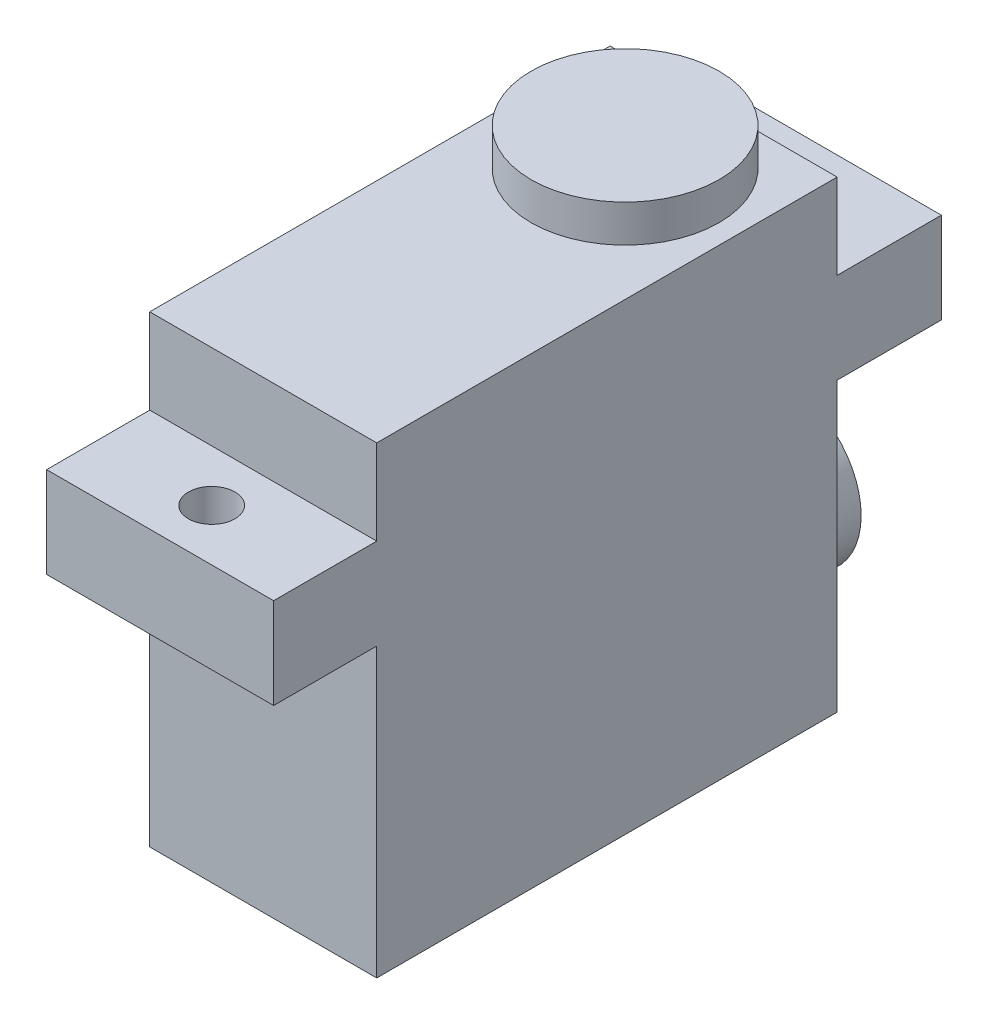
ISO-10303-21;
HEADER;
FILE_DESCRIPTION(('STEP AP214'),'2;1');
FILE_NAME('part.step','',(''),(''),'','','');
FILE_SCHEMA(('AUTOMOTIVE_DESIGN { 1 0 10303 214 1 1 1 1 }'));
ENDSEC;
DATA;
#1=APPLICATION_CONTEXT('core data for automotive mechanical design processes');
#2=APPLICATION_PROTOCOL_DEFINITION('international standard','automotive_design',2000,#1);
#3=PRODUCT_CONTEXT('',#1,'mechanical');
#4=PRODUCT('Part','Part','',(#3));
#5=PRODUCT_RELATED_PRODUCT_CATEGORY('part','',(#4));
#6=PRODUCT_DEFINITION_FORMATION('','',#4);
#7=PRODUCT_DEFINITION_CONTEXT('part definition',#1,'design');
#8=PRODUCT_DEFINITION('design','',#6,#7);
#9=PRODUCT_DEFINITION_SHAPE('','',#8);
#10=(LENGTH_UNIT() NAMED_UNIT(*) SI_UNIT(.MILLI.,.METRE.));
#11=(NAMED_UNIT(*) PLANE_ANGLE_UNIT() SI_UNIT($,.RADIAN.));
#12=(NAMED_UNIT(*) SI_UNIT($,.STERADIAN.) SOLID_ANGLE_UNIT());
#13=UNCERTAINTY_MEASURE_WITH_UNIT(LENGTH_MEASURE(1.E-05),#10,'distance_accuracy_value','');
#14=(GEOMETRIC_REPRESENTATION_CONTEXT(3) GLOBAL_UNCERTAINTY_ASSIGNED_CONTEXT((#13)) GLOBAL_UNIT_ASSIGNED_CONTEXT((#10,
#11,#12)) REPRESENTATION_CONTEXT('',''));
#15=CARTESIAN_POINT('',(0.,0.,0.));
#16=DIRECTION('',(0.,0.,1.));
#17=DIRECTION('',(1.,0.,0.));
#18=AXIS2_PLACEMENT_3D('',#15,#16,#17);
#19=CARTESIAN_POINT('',(0.,31.115,0.));
#20=DIRECTION('',(0.,0.,-1.));
#21=DIRECTION('',(-1.,0.,0.));
#22=AXIS2_PLACEMENT_3D('',#19,#20,#21);
#23=PLANE('',#22);
#24=DIRECTION('',(0.,-1.,0.));
#25=VECTOR('',#24,1.);
#26=CARTESIAN_POINT('',(0.,31.115,0.));
#27=LINE('',#26,#25);
#28=CARTESIAN_POINT('',(0.,31.115,0.));
#29=VERTEX_POINT('',#28);
#30=CARTESIAN_POINT('',(0.,25.4,0.));
#31=VERTEX_POINT('',#30);
#32=EDGE_CURVE('E214',#29,#31,#27,.T.);
#33=ORIENTED_EDGE('',*,*,#32,.T.);
#34=DIRECTION('',(1.,0.,0.));
#35=VECTOR('',#34,1.);
#36=CARTESIAN_POINT('',(0.,25.4,0.));
#37=LINE('',#36,#35);
#38=CARTESIAN_POINT('',(15.2399999999999,25.4,0.));
#39=VERTEX_POINT('',#38);
#40=EDGE_CURVE('E179',#31,#39,#37,.T.);
#41=ORIENTED_EDGE('',*,*,#40,.T.);
#42=DIRECTION('',(0.,-1.,0.));
#43=VECTOR('',#42,1.);
#44=CARTESIAN_POINT('',(15.2399999999999,31.115,0.));
#45=LINE('',#44,#43);
#46=CARTESIAN_POINT('',(15.2399999999999,31.115,0.));
#47=VERTEX_POINT('',#46);
#48=EDGE_CURVE('E211',#47,#39,#45,.T.);
#49=ORIENTED_EDGE('',*,*,#48,.F.);
#50=DIRECTION('',(1.,0.,0.));
#51=VECTOR('',#50,1.);
#52=CARTESIAN_POINT('',(0.,31.115,0.));
#53=LINE('',#52,#51);
#54=EDGE_CURVE('E186',#29,#47,#53,.T.);
#55=ORIENTED_EDGE('',*,*,#54,.F.);
#56=EDGE_LOOP('',(#33,#41,#49,#55));
#57=FACE_BOUND('',#56,.T.);
#58=ADVANCED_FACE('F38',(#57),#23,.F.);
#59=CARTESIAN_POINT('',(0.,31.115,-30.9117999999999));
#60=DIRECTION('',(0.,0.,1.));
#61=DIRECTION('',(1.,0.,0.));
#62=AXIS2_PLACEMENT_3D('',#59,#60,#61);
#63=PLANE('',#62);
#64=DIRECTION('',(0.,-1.,0.));
#65=VECTOR('',#64,1.);
#66=CARTESIAN_POINT('',(15.2399999999999,31.115,-30.9118));
#67=LINE('',#66,#65);
#68=CARTESIAN_POINT('',(15.2399999999999,31.115,-30.9118));
#69=VERTEX_POINT('',#68);
#70=CARTESIAN_POINT('',(15.2399999999999,25.4,-30.9118));
#71=VERTEX_POINT('',#70);
#72=EDGE_CURVE('E207',#69,#71,#67,.T.);
#73=ORIENTED_EDGE('',*,*,#72,.T.);
#74=DIRECTION('',(-1.,0.,0.));
#75=VECTOR('',#74,1.);
#76=CARTESIAN_POINT('',(0.,25.4,-30.9117999999999));
#77=LINE('',#76,#75);
#78=CARTESIAN_POINT('',(0.,25.4,-30.9118));
#79=VERTEX_POINT('',#78);
#80=EDGE_CURVE('E219',#71,#79,#77,.T.);
#81=ORIENTED_EDGE('',*,*,#80,.T.);
#82=DIRECTION('',(0.,-1.,0.));
#83=VECTOR('',#82,1.);
#84=CARTESIAN_POINT('',(0.,31.115,-30.9117999999999));
#85=LINE('',#84,#83);
#86=CARTESIAN_POINT('',(0.,31.115,-30.9117999999999));
#87=VERTEX_POINT('',#86);
#88=EDGE_CURVE('E203',#87,#79,#85,.T.);
#89=ORIENTED_EDGE('',*,*,#88,.F.);
#90=DIRECTION('',(-1.,0.,0.));
#91=VECTOR('',#90,1.);
#92=CARTESIAN_POINT('',(0.,31.115,-30.9117999999999));
#93=LINE('',#92,#91);
#94=EDGE_CURVE('E191',#69,#87,#93,.T.);
#95=ORIENTED_EDGE('',*,*,#94,.F.);
#96=EDGE_LOOP('',(#73,#81,#89,#95));
#97=FACE_BOUND('',#96,.T.);
#98=ADVANCED_FACE('F232',(#97),#63,.F.);
#99=CARTESIAN_POINT('',(0.,31.115,0.));
#100=DIRECTION('',(1.,0.,0.));
#101=DIRECTION('',(0.,0.,-1.));
#102=AXIS2_PLACEMENT_3D('',#99,#100,#101);
#103=PLANE('',#102);
#104=CARTESIAN_POINT('',(0.,19.304,0.));
#105=VERTEX_POINT('',#104);
#106=CARTESIAN_POINT('',(0.,0.,0.));
#107=VERTEX_POINT('',#106);
#108=EDGE_CURVE('E131',#105,#107,#27,.T.);
#109=ORIENTED_EDGE('',*,*,#108,.F.);
#110=DIRECTION('',(0.,0.,1.));
#111=VECTOR('',#110,1.);
#112=CARTESIAN_POINT('',(0.,19.304,-37.9095));
#113=LINE('',#112,#111);
#114=CARTESIAN_POINT('',(0.,19.304,6.9215));
#115=VERTEX_POINT('',#114);
#116=EDGE_CURVE('E53',#105,#115,#113,.T.);
#117=ORIENTED_EDGE('',*,*,#116,.T.);
#118=DIRECTION('',(0.,-1.,0.));
#119=VECTOR('',#118,1.);
#120=CARTESIAN_POINT('',(0.,25.4,6.9215));
#121=LINE('',#120,#119);
#122=CARTESIAN_POINT('',(0.,25.4,6.9215));
#123=VERTEX_POINT('',#122);
#124=EDGE_CURVE('E129',#123,#115,#121,.T.);
#125=ORIENTED_EDGE('',*,*,#124,.F.);
#126=DIRECTION('',(0.,0.,1.));
#127=VECTOR('',#126,1.);
#128=CARTESIAN_POINT('',(0.,25.4,-37.9095));
#129=LINE('',#128,#127);
#130=EDGE_CURVE('E171',#31,#123,#129,.T.);
#131=ORIENTED_EDGE('',*,*,#130,.F.);
#132=ORIENTED_EDGE('',*,*,#32,.F.);
#133=DIRECTION('',(0.,0.,1.));
#134=VECTOR('',#133,1.);
#135=CARTESIAN_POINT('',(0.,31.115,0.));
#136=LINE('',#135,#134);
#137=EDGE_CURVE('E183',#87,#29,#136,.T.);
#138=ORIENTED_EDGE('',*,*,#137,.F.);
#139=ORIENTED_EDGE('',*,*,#88,.T.);
#140=CARTESIAN_POINT('',(0.,25.4,-37.9095));
#141=VERTEX_POINT('',#140);
#142=EDGE_CURVE('E168',#141,#79,#129,.T.);
#143=ORIENTED_EDGE('',*,*,#142,.F.);
#144=DIRECTION('',(0.,-1.,0.));
#145=VECTOR('',#144,1.);
#146=CARTESIAN_POINT('',(0.,25.4,-37.9095));
#147=LINE('',#146,#145);
#148=CARTESIAN_POINT('',(0.,19.304,-37.9095));
#149=VERTEX_POINT('',#148);
#150=EDGE_CURVE('E158',#141,#149,#147,.T.);
#151=ORIENTED_EDGE('',*,*,#150,.T.);
#152=CARTESIAN_POINT('',(0.,19.304,-30.9118));
#153=VERTEX_POINT('',#152);
#154=EDGE_CURVE('E132',#149,#153,#113,.T.);
#155=ORIENTED_EDGE('',*,*,#154,.T.);
#156=CARTESIAN_POINT('',(0.,0.,-30.9117999999999));
#157=VERTEX_POINT('',#156);
#158=EDGE_CURVE('E193',#153,#157,#85,.T.);
#159=ORIENTED_EDGE('',*,*,#158,.T.);
#160=DIRECTION('',(0.,0.,1.));
#161=VECTOR('',#160,1.);
#162=CARTESIAN_POINT('',(0.,0.,0.));
#163=LINE('',#162,#161);
#164=EDGE_CURVE('E182',#157,#107,#163,.T.);
#165=ORIENTED_EDGE('',*,*,#164,.T.);
#166=EDGE_LOOP('',(#109,#117,#125,#131,#132,#138,#139,#143,#151,#155,#159,#165));
#167=FACE_BOUND('',#166,.T.);
#168=ADVANCED_FACE('F40',(#167),#103,.F.);
#169=CARTESIAN_POINT('',(15.2399999999999,19.304,0.));
#170=VERTEX_POINT('',#169);
#171=CARTESIAN_POINT('',(15.2399999999999,0.,0.));
#172=VERTEX_POINT('',#171);
#173=EDGE_CURVE('E210',#170,#172,#45,.T.);
#174=ORIENTED_EDGE('',*,*,#173,.F.);
#175=DIRECTION('',(-1.,0.,0.));
#176=VECTOR('',#175,1.);
#177=CARTESIAN_POINT('',(0.,19.304,0.));
#178=LINE('',#177,#176);
#179=EDGE_CURVE('E170',#170,#105,#178,.T.);
#180=ORIENTED_EDGE('',*,*,#179,.T.);
#181=ORIENTED_EDGE('',*,*,#108,.T.);
#182=DIRECTION('',(1.,0.,0.));
#183=VECTOR('',#182,1.);
#184=CARTESIAN_POINT('',(0.,0.,0.));
#185=LINE('',#184,#183);
#186=EDGE_CURVE('E195',#107,#172,#185,.T.);
#187=ORIENTED_EDGE('',*,*,#186,.T.);
#188=EDGE_LOOP('',(#174,#180,#181,#187));
#189=FACE_BOUND('',#188,.T.);
#190=ADVANCED_FACE('F252',(#189),#23,.F.);
#191=CARTESIAN_POINT('',(15.2399999999999,31.115,0.));
#192=DIRECTION('',(-1.,0.,0.));
#193=DIRECTION('',(0.,0.,1.));
#194=AXIS2_PLACEMENT_3D('',#191,#192,#193);
#195=PLANE('',#194);
#196=CARTESIAN_POINT('',(15.2399999999999,19.304,-30.9118));
#197=VERTEX_POINT('',#196);
#198=CARTESIAN_POINT('',(15.2399999999999,0.,-30.9118));
#199=VERTEX_POINT('',#198);
#200=EDGE_CURVE('E206',#197,#199,#67,.T.);
#201=ORIENTED_EDGE('',*,*,#200,.F.);
#202=DIRECTION('',(0.,0.,1.));
#203=VECTOR('',#202,1.);
#204=CARTESIAN_POINT('',(15.2399999999999,19.304,-37.9095));
#205=LINE('',#204,#203);
#206=CARTESIAN_POINT('',(15.2399999999999,19.304,-37.9095));
#207=VERTEX_POINT('',#206);
#208=EDGE_CURVE('E61',#207,#197,#205,.T.);
#209=ORIENTED_EDGE('',*,*,#208,.F.);
#210=DIRECTION('',(0.,1.,0.));
#211=VECTOR('',#210,1.);
#212=CARTESIAN_POINT('',(15.2399999999999,25.4,-37.9095));
#213=LINE('',#212,#211);
#214=CARTESIAN_POINT('',(15.2399999999999,25.4,-37.9095));
#215=VERTEX_POINT('',#214);
#216=EDGE_CURVE('E163',#207,#215,#213,.T.);
#217=ORIENTED_EDGE('',*,*,#216,.T.);
#218=DIRECTION('',(0.,0.,1.));
#219=VECTOR('',#218,1.);
#220=CARTESIAN_POINT('',(15.2399999999999,25.4,-37.9095));
#221=LINE('',#220,#219);
#222=EDGE_CURVE('E172',#215,#71,#221,.T.);
#223=ORIENTED_EDGE('',*,*,#222,.T.);
#224=ORIENTED_EDGE('',*,*,#72,.F.);
#225=DIRECTION('',(0.,0.,-1.));
#226=VECTOR('',#225,1.);
#227=CARTESIAN_POINT('',(15.2399999999999,31.115,0.));
#228=LINE('',#227,#226);
#229=EDGE_CURVE('E189',#47,#69,#228,.T.);
#230=ORIENTED_EDGE('',*,*,#229,.F.);
#231=ORIENTED_EDGE('',*,*,#48,.T.);
#232=CARTESIAN_POINT('',(15.2399999999999,25.4,6.9215));
#233=VERTEX_POINT('',#232);
#234=EDGE_CURVE('E175',#39,#233,#221,.T.);
#235=ORIENTED_EDGE('',*,*,#234,.T.);
#236=DIRECTION('',(0.,1.,0.));
#237=VECTOR('',#236,1.);
#238=CARTESIAN_POINT('',(15.2399999999999,25.4,6.9215));
#239=LINE('',#238,#237);
#240=CARTESIAN_POINT('',(15.2399999999999,19.304,6.9215));
#241=VERTEX_POINT('',#240);
#242=EDGE_CURVE('E143',#241,#233,#239,.T.);
#243=ORIENTED_EDGE('',*,*,#242,.F.);
#244=EDGE_CURVE('E139',#170,#241,#205,.T.);
#245=ORIENTED_EDGE('',*,*,#244,.F.);
#246=ORIENTED_EDGE('',*,*,#173,.T.);
#247=DIRECTION('',(0.,0.,-1.));
#248=VECTOR('',#247,1.);
#249=CARTESIAN_POINT('',(15.2399999999999,0.,0.));
#250=LINE('',#249,#248);
#251=EDGE_CURVE('E198',#172,#199,#250,.T.);
#252=ORIENTED_EDGE('',*,*,#251,.T.);
#253=EDGE_LOOP('',(#201,#209,#217,#223,#224,#230,#231,#235,#243,#245,#246,#252));
#254=FACE_BOUND('',#253,.T.);
#255=ADVANCED_FACE('F230',(#254),#195,.F.);
#256=CARTESIAN_POINT('',(7.61999999999996,8.2804,-30.9118));
#257=DIRECTION('',(0.,0.,1.));
#258=DIRECTION('',(1.,0.,0.));
#259=AXIS2_PLACEMENT_3D('',#256,#257,#258);
#260=CIRCLE('',#259,5.2705);
#261=CARTESIAN_POINT('',(12.8905,8.2804,-30.9118));
#262=VERTEX_POINT('',#261);
#263=EDGE_CURVE('E46',#262,#262,#260,.F.);
#264=ORIENTED_EDGE('',*,*,#263,.F.);
#265=EDGE_LOOP('',(#264));
#266=FACE_BOUND('',#265,.T.);
#267=ORIENTED_EDGE('',*,*,#158,.F.);
#268=DIRECTION('',(1.,0.,0.));
#269=VECTOR('',#268,1.);
#270=CARTESIAN_POINT('',(0.,19.304,-30.9117999999999));
#271=LINE('',#270,#269);
#272=EDGE_CURVE('E217',#153,#197,#271,.T.);
#273=ORIENTED_EDGE('',*,*,#272,.T.);
#274=ORIENTED_EDGE('',*,*,#200,.T.);
#275=DIRECTION('',(-1.,0.,0.));
#276=VECTOR('',#275,1.);
#277=CARTESIAN_POINT('',(0.,0.,-30.9117999999999));
#278=LINE('',#277,#276);
#279=EDGE_CURVE('E187',#199,#157,#278,.T.);
#280=ORIENTED_EDGE('',*,*,#279,.T.);
#281=EDGE_LOOP('',(#267,#273,#274,#280));
#282=FACE_BOUND('',#281,.T.);
#283=ADVANCED_FACE('F226',(#266,#282),#63,.F.);
#284=CARTESIAN_POINT('',(0.,31.115,0.));
#285=DIRECTION('',(0.,-1.,0.));
#286=DIRECTION('',(0.,0.,-1.));
#287=AXIS2_PLACEMENT_3D('',#284,#285,#286);
#288=PLANE('',#287);
#289=CARTESIAN_POINT('',(7.61999999999996,31.115,-24.2951));
#290=DIRECTION('',(0.,-1.,0.));
#291=DIRECTION('',(0.,0.,-1.));
#292=AXIS2_PLACEMENT_3D('',#289,#290,#291);
#293=CIRCLE('',#292,6.3119);
#294=CARTESIAN_POINT('',(7.61999999999996,31.115,-30.607));
#295=VERTEX_POINT('',#294);
#296=EDGE_CURVE('E11',#295,#295,#293,.F.);
#297=ORIENTED_EDGE('',*,*,#296,.F.);
#298=EDGE_LOOP('',(#297));
#299=FACE_BOUND('',#298,.T.);
#300=ORIENTED_EDGE('',*,*,#137,.T.);
#301=ORIENTED_EDGE('',*,*,#54,.T.);
#302=ORIENTED_EDGE('',*,*,#229,.T.);
#303=ORIENTED_EDGE('',*,*,#94,.T.);
#304=EDGE_LOOP('',(#300,#301,#302,#303));
#305=FACE_BOUND('',#304,.T.);
#306=ADVANCED_FACE('F229',(#299,#305),#288,.F.);
#307=CARTESIAN_POINT('',(0.,0.,0.));
#308=DIRECTION('',(0.,-1.,0.));
#309=DIRECTION('',(0.,0.,-1.));
#310=AXIS2_PLACEMENT_3D('',#307,#308,#309);
#311=PLANE('',#310);
#312=ORIENTED_EDGE('',*,*,#164,.F.);
#313=ORIENTED_EDGE('',*,*,#279,.F.);
#314=ORIENTED_EDGE('',*,*,#251,.F.);
#315=ORIENTED_EDGE('',*,*,#186,.F.);
#316=EDGE_LOOP('',(#312,#313,#314,#315));
#317=FACE_BOUND('',#316,.T.);
#318=ADVANCED_FACE('F250',(#317),#311,.T.);
#319=CARTESIAN_POINT('',(0.,0.,-37.9095));
#320=DIRECTION('',(0.,0.,1.));
#321=DIRECTION('',(1.,0.,0.));
#322=AXIS2_PLACEMENT_3D('',#319,#320,#321);
#323=PLANE('',#322);
#324=ORIENTED_EDGE('',*,*,#150,.F.);
#325=DIRECTION('',(-1.,0.,0.));
#326=VECTOR('',#325,1.);
#327=CARTESIAN_POINT('',(0.,25.4,-37.9095));
#328=LINE('',#327,#326);
#329=EDGE_CURVE('E133',#215,#141,#328,.T.);
#330=ORIENTED_EDGE('',*,*,#329,.F.);
#331=ORIENTED_EDGE('',*,*,#216,.F.);
#332=DIRECTION('',(1.,0.,0.));
#333=VECTOR('',#332,1.);
#334=CARTESIAN_POINT('',(0.,19.304,-37.9095));
#335=LINE('',#334,#333);
#336=EDGE_CURVE('E161',#149,#207,#335,.T.);
#337=ORIENTED_EDGE('',*,*,#336,.F.);
#338=EDGE_LOOP('',(#324,#330,#331,#337));
#339=FACE_BOUND('',#338,.T.);
#340=ADVANCED_FACE('F242',(#339),#323,.F.);
#341=CARTESIAN_POINT('',(0.,19.304,-37.9095));
#342=DIRECTION('',(0.,-1.,0.));
#343=DIRECTION('',(0.,0.,-1.));
#344=AXIS2_PLACEMENT_3D('',#341,#342,#343);
#345=PLANE('',#344);
#346=CARTESIAN_POINT('',(7.61999999999996,19.304,-34.41065));
#347=DIRECTION('',(0.,-1.,0.));
#348=DIRECTION('',(0.,0.,-1.));
#349=AXIS2_PLACEMENT_3D('',#346,#347,#348);
#350=CIRCLE('',#349,1.5621);
#351=CARTESIAN_POINT('',(7.61999999999996,19.304,-35.97275));
#352=VERTEX_POINT('',#351);
#353=EDGE_CURVE('E425',#352,#352,#350,.F.);
#354=ORIENTED_EDGE('',*,*,#353,.T.);
#355=EDGE_LOOP('',(#354));
#356=FACE_BOUND('',#355,.T.);
#357=ORIENTED_EDGE('',*,*,#272,.F.);
#358=ORIENTED_EDGE('',*,*,#154,.F.);
#359=ORIENTED_EDGE('',*,*,#336,.T.);
#360=ORIENTED_EDGE('',*,*,#208,.T.);
#361=EDGE_LOOP('',(#357,#358,#359,#360));
#362=FACE_BOUND('',#361,.T.);
#363=ADVANCED_FACE('F239',(#356,#362),#345,.T.);
#364=CARTESIAN_POINT('',(0.,25.4,-37.9095));
#365=DIRECTION('',(0.,1.,0.));
#366=DIRECTION('',(0.,0.,1.));
#367=AXIS2_PLACEMENT_3D('',#364,#365,#366);
#368=PLANE('',#367);
#369=CARTESIAN_POINT('',(7.61999999999996,25.4,-34.41065));
#370=DIRECTION('',(0.,1.,0.));
#371=DIRECTION('',(0.,0.,1.));
#372=AXIS2_PLACEMENT_3D('',#369,#370,#371);
#373=CIRCLE('',#372,1.5621);
#374=CARTESIAN_POINT('',(7.61999999999996,25.4,-32.84855));
#375=VERTEX_POINT('',#374);
#376=EDGE_CURVE('E420',#375,#375,#373,.T.);
#377=ORIENTED_EDGE('',*,*,#376,.F.);
#378=EDGE_LOOP('',(#377));
#379=FACE_BOUND('',#378,.T.);
#380=ORIENTED_EDGE('',*,*,#80,.F.);
#381=ORIENTED_EDGE('',*,*,#222,.F.);
#382=ORIENTED_EDGE('',*,*,#329,.T.);
#383=ORIENTED_EDGE('',*,*,#142,.T.);
#384=EDGE_LOOP('',(#380,#381,#382,#383));
#385=FACE_BOUND('',#384,.T.);
#386=ADVANCED_FACE('F265',(#379,#385),#368,.T.);
#387=CARTESIAN_POINT('',(7.61999999999996,25.4,3.46075));
#388=DIRECTION('',(0.,1.,0.));
#389=DIRECTION('',(0.,0.,1.));
#390=AXIS2_PLACEMENT_3D('',#387,#388,#389);
#391=CIRCLE('',#390,1.5621);
#392=CARTESIAN_POINT('',(7.61999999999996,25.4,5.02285));
#393=VERTEX_POINT('',#392);
#394=EDGE_CURVE('E419',#393,#393,#391,.T.);
#395=ORIENTED_EDGE('',*,*,#394,.F.);
#396=EDGE_LOOP('',(#395));
#397=FACE_BOUND('',#396,.T.);
#398=ORIENTED_EDGE('',*,*,#40,.F.);
#399=ORIENTED_EDGE('',*,*,#130,.T.);
#400=DIRECTION('',(-1.,0.,0.));
#401=VECTOR('',#400,1.);
#402=CARTESIAN_POINT('',(0.,25.4,6.9215));
#403=LINE('',#402,#401);
#404=EDGE_CURVE('E148',#233,#123,#403,.T.);
#405=ORIENTED_EDGE('',*,*,#404,.F.);
#406=ORIENTED_EDGE('',*,*,#234,.F.);
#407=EDGE_LOOP('',(#398,#399,#405,#406));
#408=FACE_BOUND('',#407,.T.);
#409=ADVANCED_FACE('F254',(#397,#408),#368,.T.);
#410=CARTESIAN_POINT('',(7.61999999999996,19.304,3.46075));
#411=DIRECTION('',(0.,-1.,0.));
#412=DIRECTION('',(0.,0.,-1.));
#413=AXIS2_PLACEMENT_3D('',#410,#411,#412);
#414=CIRCLE('',#413,1.5621);
#415=CARTESIAN_POINT('',(7.61999999999996,19.304,1.89865));
#416=VERTEX_POINT('',#415);
#417=EDGE_CURVE('E418',#416,#416,#414,.F.);
#418=ORIENTED_EDGE('',*,*,#417,.T.);
#419=EDGE_LOOP('',(#418));
#420=FACE_BOUND('',#419,.T.);
#421=ORIENTED_EDGE('',*,*,#179,.F.);
#422=ORIENTED_EDGE('',*,*,#244,.T.);
#423=DIRECTION('',(1.,0.,0.));
#424=VECTOR('',#423,1.);
#425=CARTESIAN_POINT('',(0.,19.304,6.9215));
#426=LINE('',#425,#424);
#427=EDGE_CURVE('E136',#115,#241,#426,.T.);
#428=ORIENTED_EDGE('',*,*,#427,.F.);
#429=ORIENTED_EDGE('',*,*,#116,.F.);
#430=EDGE_LOOP('',(#421,#422,#428,#429));
#431=FACE_BOUND('',#430,.T.);
#432=ADVANCED_FACE('F137',(#420,#431),#345,.T.);
#433=CARTESIAN_POINT('',(0.,0.,6.9215));
#434=DIRECTION('',(0.,0.,1.));
#435=DIRECTION('',(1.,0.,0.));
#436=AXIS2_PLACEMENT_3D('',#433,#434,#435);
#437=PLANE('',#436);
#438=ORIENTED_EDGE('',*,*,#124,.T.);
#439=ORIENTED_EDGE('',*,*,#427,.T.);
#440=ORIENTED_EDGE('',*,*,#242,.T.);
#441=ORIENTED_EDGE('',*,*,#404,.T.);
#442=EDGE_LOOP('',(#438,#439,#440,#441));
#443=FACE_BOUND('',#442,.T.);
#444=ADVANCED_FACE('F146',(#443),#437,.T.);
#445=CARTESIAN_POINT('',(7.61999999999994,8.2804,-34.8742));
#446=DIRECTION('',(0.,0.,1.));
#447=DIRECTION('',(1.,0.,0.));
#448=AXIS2_PLACEMENT_3D('',#445,#446,#447);
#449=CYLINDRICAL_SURFACE('',#448,5.2705);
#450=CARTESIAN_POINT('',(7.61999999999994,8.2804,-34.8742));
#451=DIRECTION('',(0.,0.,-1.));
#452=DIRECTION('',(-1.,0.,0.));
#453=AXIS2_PLACEMENT_3D('',#450,#451,#452);
#454=CIRCLE('',#453,5.2705);
#455=CARTESIAN_POINT('',(2.34949999999994,8.2804,-34.8741999999999));
#456=VERTEX_POINT('',#455);
#457=EDGE_CURVE('E149',#456,#456,#454,.T.);
#458=ORIENTED_EDGE('',*,*,#457,.F.);
#459=EDGE_LOOP('',(#458));
#460=FACE_BOUND('',#459,.T.);
#461=ORIENTED_EDGE('',*,*,#263,.T.);
#462=EDGE_LOOP('',(#461));
#463=FACE_BOUND('',#462,.T.);
#464=ADVANCED_FACE('F224',(#460,#463),#449,.T.);
#465=CARTESIAN_POINT('',(7.61999999999994,8.2804,-34.8742));
#466=DIRECTION('',(0.,0.,-1.));
#467=DIRECTION('',(-1.,0.,0.));
#468=AXIS2_PLACEMENT_3D('',#465,#466,#467);
#469=PLANE('',#468);
#470=ORIENTED_EDGE('',*,*,#457,.T.);
#471=EDGE_LOOP('',(#470));
#472=FACE_BOUND('',#471,.T.);
#473=ADVANCED_FACE('F365',(#472),#469,.T.);
#474=CARTESIAN_POINT('',(7.61999999999996,33.6169,-24.2951));
#475=DIRECTION('',(0.,-1.,0.));
#476=DIRECTION('',(0.,0.,-1.));
#477=AXIS2_PLACEMENT_3D('',#474,#475,#476);
#478=CYLINDRICAL_SURFACE('',#477,6.3119);
#479=CARTESIAN_POINT('',(7.61999999999996,33.6169,-24.2951));
#480=DIRECTION('',(0.,1.,0.));
#481=DIRECTION('',(0.,0.,1.));
#482=AXIS2_PLACEMENT_3D('',#479,#480,#481);
#483=CIRCLE('',#482,6.3119);
#484=CARTESIAN_POINT('',(7.61999999999996,33.6169,-17.9832));
#485=VERTEX_POINT('',#484);
#486=EDGE_CURVE('E152',#485,#485,#483,.T.);
#487=ORIENTED_EDGE('',*,*,#486,.F.);
#488=EDGE_LOOP('',(#487));
#489=FACE_BOUND('',#488,.T.);
#490=ORIENTED_EDGE('',*,*,#296,.T.);
#491=EDGE_LOOP('',(#490));
#492=FACE_BOUND('',#491,.T.);
#493=ADVANCED_FACE('F356',(#489,#492),#478,.T.);
#494=CARTESIAN_POINT('',(7.61999999999996,33.6169,-24.2951));
#495=DIRECTION('',(0.,1.,0.));
#496=DIRECTION('',(0.,0.,1.));
#497=AXIS2_PLACEMENT_3D('',#494,#495,#496);
#498=PLANE('',#497);
#499=ORIENTED_EDGE('',*,*,#486,.T.);
#500=EDGE_LOOP('',(#499));
#501=FACE_BOUND('',#500,.T.);
#502=ADVANCED_FACE('F350',(#501),#498,.T.);
#503=CARTESIAN_POINT('',(7.61999999999996,-0.001000000000001,3.46075));
#504=DIRECTION('',(0.,1.,0.));
#505=DIRECTION('',(0.,0.,1.));
#506=AXIS2_PLACEMENT_3D('',#503,#504,#505);
#507=CYLINDRICAL_SURFACE('',#506,1.5621);
#508=ORIENTED_EDGE('',*,*,#417,.F.);
#509=EDGE_LOOP('',(#508));
#510=FACE_BOUND('',#509,.T.);
#511=ORIENTED_EDGE('',*,*,#394,.T.);
#512=EDGE_LOOP('',(#511));
#513=FACE_BOUND('',#512,.T.);
#514=ADVANCED_FACE('F329',(#510,#513),#507,.F.);
#515=CARTESIAN_POINT('',(7.61999999999996,-0.001000000000001,-34.41065));
#516=DIRECTION('',(0.,1.,0.));
#517=DIRECTION('',(0.,0.,1.));
#518=AXIS2_PLACEMENT_3D('',#515,#516,#517);
#519=CYLINDRICAL_SURFACE('',#518,1.5621);
#520=ORIENTED_EDGE('',*,*,#353,.F.);
#521=EDGE_LOOP('',(#520));
#522=FACE_BOUND('',#521,.T.);
#523=ORIENTED_EDGE('',*,*,#376,.T.);
#524=EDGE_LOOP('',(#523));
#525=FACE_BOUND('',#524,.T.);
#526=ADVANCED_FACE('F339',(#522,#525),#519,.F.);
#527=CLOSED_SHELL('',(#58,#98,#168,#190,#255,#283,#306,#318,#340,#363,#386,#409,#432,#444,#464,
#473,#493,#502,#514,#526));
#528=MANIFOLD_SOLID_BREP('B2',#527);
#529=ADVANCED_BREP_SHAPE_REPRESENTATION('',(#18,#528),#14);
#530=SHAPE_DEFINITION_REPRESENTATION(#9,#529);
ENDSEC;
END-ISO-10303-21;
